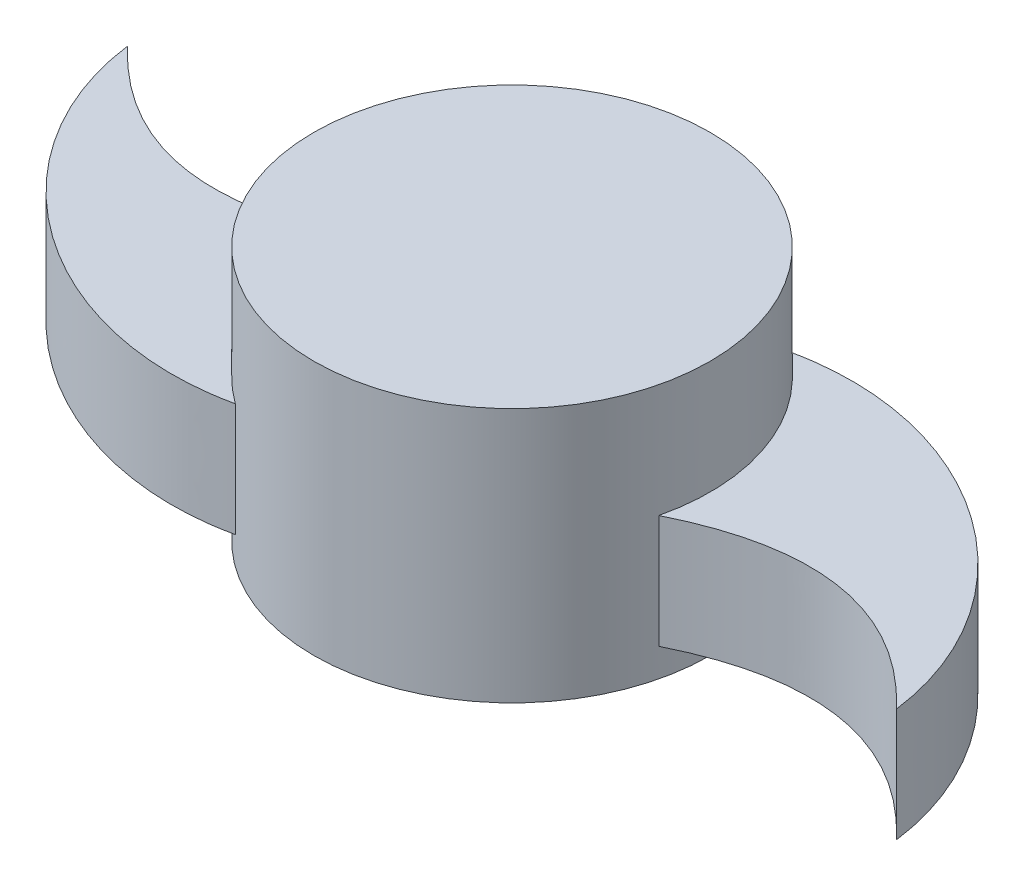
ISO-10303-21;
HEADER;
FILE_DESCRIPTION(('STEP AP214'),'2;1');
FILE_NAME('part.step','',(''),(''),'','','');
FILE_SCHEMA(('AUTOMOTIVE_DESIGN { 1 0 10303 214 1 1 1 1 }'));
ENDSEC;
DATA;
#1=APPLICATION_CONTEXT('core data for automotive mechanical design processes');
#2=APPLICATION_PROTOCOL_DEFINITION('international standard','automotive_design',2000,#1);
#3=PRODUCT_CONTEXT('',#1,'mechanical');
#4=PRODUCT('Part','Part','',(#3));
#5=PRODUCT_RELATED_PRODUCT_CATEGORY('part','',(#4));
#6=PRODUCT_DEFINITION_FORMATION('','',#4);
#7=PRODUCT_DEFINITION_CONTEXT('part definition',#1,'design');
#8=PRODUCT_DEFINITION('design','',#6,#7);
#9=PRODUCT_DEFINITION_SHAPE('','',#8);
#10=(LENGTH_UNIT() NAMED_UNIT(*) SI_UNIT(.MILLI.,.METRE.));
#11=(NAMED_UNIT(*) PLANE_ANGLE_UNIT() SI_UNIT($,.RADIAN.));
#12=(NAMED_UNIT(*) SI_UNIT($,.STERADIAN.) SOLID_ANGLE_UNIT());
#13=UNCERTAINTY_MEASURE_WITH_UNIT(LENGTH_MEASURE(1.E-05),#10,'distance_accuracy_value','');
#14=(GEOMETRIC_REPRESENTATION_CONTEXT(3) GLOBAL_UNCERTAINTY_ASSIGNED_CONTEXT((#13)) GLOBAL_UNIT_ASSIGNED_CONTEXT((#10,
#11,#12)) REPRESENTATION_CONTEXT('',''));
#15=CARTESIAN_POINT('',(0.,0.,0.));
#16=DIRECTION('',(0.,0.,1.));
#17=DIRECTION('',(1.,0.,0.));
#18=AXIS2_PLACEMENT_3D('',#15,#16,#17);
#19=CARTESIAN_POINT('',(0.,57.15,0.));
#20=DIRECTION('',(0.,-1.,0.));
#21=DIRECTION('',(0.,0.,-1.));
#22=AXIS2_PLACEMENT_3D('',#19,#20,#21);
#23=CYLINDRICAL_SURFACE('',#22,44.45);
#24=DIRECTION('',(0.,-1.,0.));
#25=VECTOR('',#24,1.);
#26=CARTESIAN_POINT('',(-43.2341522038029,31.75,-10.3252401046373));
#27=LINE('',#26,#25);
#28=CARTESIAN_POINT('',(-43.2341522038028,31.75,-10.3252401046373));
#29=VERTEX_POINT('',#28);
#30=CARTESIAN_POINT('',(-43.2341522038028,6.35,-10.3252401046373));
#31=VERTEX_POINT('',#30);
#32=EDGE_CURVE('E51',#29,#31,#27,.T.);
#33=ORIENTED_EDGE('',*,*,#32,.F.);
#34=CARTESIAN_POINT('',(0.,31.75,0.));
#35=DIRECTION('',(0.,-1.,0.));
#36=DIRECTION('',(0.,0.,-1.));
#37=AXIS2_PLACEMENT_3D('',#34,#35,#36);
#38=CIRCLE('',#37,44.45);
#39=CARTESIAN_POINT('',(-25.9383628900159,31.75,36.0971443550019));
#40=VERTEX_POINT('',#39);
#41=EDGE_CURVE('E46',#40,#29,#38,.T.);
#42=ORIENTED_EDGE('',*,*,#41,.F.);
#43=DIRECTION('',(0.,-1.,0.));
#44=VECTOR('',#43,1.);
#45=CARTESIAN_POINT('',(-25.9383628900159,31.75,36.0971443550019));
#46=LINE('',#45,#44);
#47=CARTESIAN_POINT('',(-25.9383628900159,6.35,36.0971443550019));
#48=VERTEX_POINT('',#47);
#49=EDGE_CURVE('E99',#40,#48,#46,.T.);
#50=ORIENTED_EDGE('',*,*,#49,.T.);
#51=CARTESIAN_POINT('',(0.,6.35,0.));
#52=DIRECTION('',(0.,-1.,0.));
#53=DIRECTION('',(0.,0.,-1.));
#54=AXIS2_PLACEMENT_3D('',#51,#52,#53);
#55=CIRCLE('',#54,44.45);
#56=EDGE_CURVE('E102',#48,#31,#55,.T.);
#57=ORIENTED_EDGE('',*,*,#56,.T.);
#58=EDGE_LOOP('',(#33,#42,#50,#57));
#59=FACE_BOUND('',#58,.T.);
#60=DIRECTION('',(0.,-1.,0.));
#61=VECTOR('',#60,1.);
#62=CARTESIAN_POINT('',(43.2341522038028,31.75,10.3252401046374));
#63=LINE('',#62,#61);
#64=CARTESIAN_POINT('',(43.2341522038028,31.75,10.3252401046374));
#65=VERTEX_POINT('',#64);
#66=CARTESIAN_POINT('',(43.2341522038028,6.35,10.3252401046374));
#67=VERTEX_POINT('',#66);
#68=EDGE_CURVE('E162',#65,#67,#63,.T.);
#69=ORIENTED_EDGE('',*,*,#68,.F.);
#70=CARTESIAN_POINT('',(0.,31.75,0.));
#71=DIRECTION('',(0.,-1.,0.));
#72=DIRECTION('',(0.,0.,-1.));
#73=AXIS2_PLACEMENT_3D('',#70,#71,#72);
#74=CIRCLE('',#73,44.45);
#75=CARTESIAN_POINT('',(25.9383628900159,31.75,-36.0971443550019));
#76=VERTEX_POINT('',#75);
#77=EDGE_CURVE('E138',#76,#65,#74,.T.);
#78=ORIENTED_EDGE('',*,*,#77,.F.);
#79=DIRECTION('',(0.,-1.,0.));
#80=VECTOR('',#79,1.);
#81=CARTESIAN_POINT('',(25.9383628900159,31.75,-36.0971443550019));
#82=LINE('',#81,#80);
#83=CARTESIAN_POINT('',(25.9383628900159,6.35,-36.0971443550019));
#84=VERTEX_POINT('',#83);
#85=EDGE_CURVE('E165',#76,#84,#82,.T.);
#86=ORIENTED_EDGE('',*,*,#85,.T.);
#87=CARTESIAN_POINT('',(0.,6.35,0.));
#88=DIRECTION('',(0.,-1.,0.));
#89=DIRECTION('',(0.,0.,-1.));
#90=AXIS2_PLACEMENT_3D('',#87,#88,#89);
#91=CIRCLE('',#90,44.45);
#92=EDGE_CURVE('E147',#84,#67,#91,.T.);
#93=ORIENTED_EDGE('',*,*,#92,.T.);
#94=EDGE_LOOP('',(#69,#78,#86,#93));
#95=FACE_BOUND('',#94,.T.);
#96=CARTESIAN_POINT('',(0.,57.15,0.));
#97=DIRECTION('',(0.,1.,0.));
#98=DIRECTION('',(0.,0.,1.));
#99=AXIS2_PLACEMENT_3D('',#96,#97,#98);
#100=CIRCLE('',#99,44.45);
#101=CARTESIAN_POINT('',(0.,57.15,44.45));
#102=VERTEX_POINT('',#101);
#103=EDGE_CURVE('E11',#102,#102,#100,.T.);
#104=ORIENTED_EDGE('',*,*,#103,.F.);
#105=EDGE_LOOP('',(#104));
#106=FACE_BOUND('',#105,.T.);
#107=CARTESIAN_POINT('',(0.,0.,0.));
#108=DIRECTION('',(0.,1.,0.));
#109=DIRECTION('',(0.,0.,1.));
#110=AXIS2_PLACEMENT_3D('',#107,#108,#109);
#111=CIRCLE('',#110,44.45);
#112=CARTESIAN_POINT('',(0.,0.,44.45));
#113=VERTEX_POINT('',#112);
#114=EDGE_CURVE('E35',#113,#113,#111,.T.);
#115=ORIENTED_EDGE('',*,*,#114,.T.);
#116=EDGE_LOOP('',(#115));
#117=FACE_BOUND('',#116,.T.);
#118=ADVANCED_FACE('F32',(#59,#95,#106,#117),#23,.T.);
#119=CARTESIAN_POINT('',(0.,57.15,0.));
#120=DIRECTION('',(0.,1.,0.));
#121=DIRECTION('',(0.,0.,1.));
#122=AXIS2_PLACEMENT_3D('',#119,#120,#121);
#123=PLANE('',#122);
#124=ORIENTED_EDGE('',*,*,#103,.T.);
#125=EDGE_LOOP('',(#124));
#126=FACE_BOUND('',#125,.T.);
#127=ADVANCED_FACE('F175',(#126),#123,.T.);
#128=CARTESIAN_POINT('',(0.,0.,0.));
#129=DIRECTION('',(0.,1.,0.));
#130=DIRECTION('',(0.,0.,1.));
#131=AXIS2_PLACEMENT_3D('',#128,#129,#130);
#132=PLANE('',#131);
#133=ORIENTED_EDGE('',*,*,#114,.F.);
#134=EDGE_LOOP('',(#133));
#135=FACE_BOUND('',#134,.T.);
#136=ADVANCED_FACE('F173',(#135),#132,.F.);
#137=CARTESIAN_POINT('',(107.471459219682,31.75,21.3033686745085));
#138=CARTESIAN_POINT('',(102.789157254803,31.75,-15.3743746848465));
#139=CARTESIAN_POINT('',(62.8492697785304,31.75,-44.250068413422));
#140=CARTESIAN_POINT('',(25.9383628900159,31.75,-36.0971443550019));
#141=B_SPLINE_CURVE_WITH_KNOTS('',3,(#137,#138,#139,#140),.UNSPECIFIED.,.F.,.F.,(4,4),(0.,1.),.UNSPECIFIED.);
#142=DIRECTION('',(0.,-1.,0.));
#143=VECTOR('',#142,1.);
#144=SURFACE_OF_LINEAR_EXTRUSION('',#141,#143);
#145=CARTESIAN_POINT('',(107.471459219682,6.35,21.3033686745085));
#146=CARTESIAN_POINT('',(102.789157254803,6.35,-15.3743746848465));
#147=CARTESIAN_POINT('',(62.8492697785304,6.35,-44.250068413422));
#148=CARTESIAN_POINT('',(25.9383628900159,6.35,-36.0971443550019));
#149=B_SPLINE_CURVE_WITH_KNOTS('',3,(#145,#146,#147,#148),.UNSPECIFIED.,.F.,.F.,(4,4),(0.,1.),.UNSPECIFIED.);
#150=CARTESIAN_POINT('',(107.471459219682,6.35,21.3033686745085));
#151=VERTEX_POINT('',#150);
#152=EDGE_CURVE('E139',#151,#84,#149,.T.);
#153=ORIENTED_EDGE('',*,*,#152,.T.);
#154=ORIENTED_EDGE('',*,*,#85,.F.);
#155=CARTESIAN_POINT('',(107.471459219682,31.75,21.3033686745085));
#156=VERTEX_POINT('',#155);
#157=EDGE_CURVE('E156',#156,#76,#141,.T.);
#158=ORIENTED_EDGE('',*,*,#157,.F.);
#159=DIRECTION('',(0.,-1.,0.));
#160=VECTOR('',#159,1.);
#161=CARTESIAN_POINT('',(107.471459219682,31.75,21.3033686745085));
#162=LINE('',#161,#160);
#163=EDGE_CURVE('E137',#156,#151,#162,.T.);
#164=ORIENTED_EDGE('',*,*,#163,.T.);
#165=EDGE_LOOP('',(#153,#154,#158,#164));
#166=FACE_BOUND('',#165,.T.);
#167=ADVANCED_FACE('F127',(#166),#144,.F.);
#168=CARTESIAN_POINT('',(43.2341522038028,31.75,10.3252401046374));
#169=CARTESIAN_POINT('',(79.9424189658603,31.75,-7.90926282177319));
#170=CARTESIAN_POINT('',(107.471459219682,31.75,21.3033686745085));
#171=B_SPLINE_CURVE_WITH_KNOTS('',2,(#168,#169,#170),.UNSPECIFIED.,.F.,.F.,(3,3),(0.,1.),.UNSPECIFIED.);
#172=DIRECTION('',(0.,-1.,0.));
#173=VECTOR('',#172,1.);
#174=SURFACE_OF_LINEAR_EXTRUSION('',#171,#173);
#175=CARTESIAN_POINT('',(43.2341522038028,6.35,10.3252401046374));
#176=CARTESIAN_POINT('',(79.9424189658603,6.35,-7.90926282177319));
#177=CARTESIAN_POINT('',(107.471459219682,6.35,21.3033686745085));
#178=B_SPLINE_CURVE_WITH_KNOTS('',2,(#175,#176,#177),.UNSPECIFIED.,.F.,.F.,(3,3),(0.,1.),.UNSPECIFIED.);
#179=EDGE_CURVE('E152',#67,#151,#178,.T.);
#180=ORIENTED_EDGE('',*,*,#179,.T.);
#181=ORIENTED_EDGE('',*,*,#163,.F.);
#182=EDGE_CURVE('E131',#65,#156,#171,.T.);
#183=ORIENTED_EDGE('',*,*,#182,.F.);
#184=ORIENTED_EDGE('',*,*,#68,.T.);
#185=EDGE_LOOP('',(#180,#181,#183,#184));
#186=FACE_BOUND('',#185,.T.);
#187=ADVANCED_FACE('F119',(#186),#174,.F.);
#188=CARTESIAN_POINT('',(78.7906379012124,31.75,-24.2083881219123));
#189=DIRECTION('',(0.,1.,0.));
#190=DIRECTION('',(0.,0.,1.));
#191=AXIS2_PLACEMENT_3D('',#188,#189,#190);
#192=PLANE('',#191);
#193=ORIENTED_EDGE('',*,*,#157,.T.);
#194=ORIENTED_EDGE('',*,*,#77,.T.);
#195=ORIENTED_EDGE('',*,*,#182,.T.);
#196=EDGE_LOOP('',(#193,#194,#195));
#197=FACE_BOUND('',#196,.T.);
#198=ADVANCED_FACE('F116',(#197),#192,.T.);
#199=CARTESIAN_POINT('',(78.7906379012124,6.35,-24.2083881219123));
#200=DIRECTION('',(0.,1.,0.));
#201=DIRECTION('',(0.,0.,1.));
#202=AXIS2_PLACEMENT_3D('',#199,#200,#201);
#203=PLANE('',#202);
#204=ORIENTED_EDGE('',*,*,#152,.F.);
#205=ORIENTED_EDGE('',*,*,#179,.F.);
#206=ORIENTED_EDGE('',*,*,#92,.F.);
#207=EDGE_LOOP('',(#204,#205,#206));
#208=FACE_BOUND('',#207,.T.);
#209=ADVANCED_FACE('F114',(#208),#203,.F.);
#210=CARTESIAN_POINT('',(-107.471459219682,31.75,-21.3033686745085));
#211=CARTESIAN_POINT('',(-102.789157254803,31.75,15.3743746848465));
#212=CARTESIAN_POINT('',(-62.8492697785305,31.75,44.250068413422));
#213=CARTESIAN_POINT('',(-25.9383628900159,31.75,36.0971443550019));
#214=B_SPLINE_CURVE_WITH_KNOTS('',3,(#210,#211,#212,#213),.UNSPECIFIED.,.F.,.F.,(4,4),(0.,1.),.UNSPECIFIED.);
#215=DIRECTION('',(0.,-1.,0.));
#216=VECTOR('',#215,1.);
#217=SURFACE_OF_LINEAR_EXTRUSION('',#214,#216);
#218=CARTESIAN_POINT('',(-107.471459219682,6.35,-21.3033686745085));
#219=CARTESIAN_POINT('',(-102.789157254803,6.35,15.3743746848465));
#220=CARTESIAN_POINT('',(-62.8492697785305,6.35,44.250068413422));
#221=CARTESIAN_POINT('',(-25.9383628900159,6.35,36.0971443550019));
#222=B_SPLINE_CURVE_WITH_KNOTS('',3,(#218,#219,#220,#221),.UNSPECIFIED.,.F.,.F.,(4,4),(0.,1.),.UNSPECIFIED.);
#223=CARTESIAN_POINT('',(-107.471459219682,6.35,-21.3033686745085));
#224=VERTEX_POINT('',#223);
#225=EDGE_CURVE('E209',#224,#48,#222,.T.);
#226=ORIENTED_EDGE('',*,*,#225,.T.);
#227=ORIENTED_EDGE('',*,*,#49,.F.);
#228=CARTESIAN_POINT('',(-107.471459219682,31.75,-21.3033686745085));
#229=VERTEX_POINT('',#228);
#230=EDGE_CURVE('E85',#229,#40,#214,.T.);
#231=ORIENTED_EDGE('',*,*,#230,.F.);
#232=DIRECTION('',(0.,-1.,0.));
#233=VECTOR('',#232,1.);
#234=CARTESIAN_POINT('',(-107.471459219682,31.75,-21.3033686745085));
#235=LINE('',#234,#233);
#236=EDGE_CURVE('E88',#229,#224,#235,.T.);
#237=ORIENTED_EDGE('',*,*,#236,.T.);
#238=EDGE_LOOP('',(#226,#227,#231,#237));
#239=FACE_BOUND('',#238,.T.);
#240=ADVANCED_FACE('F98',(#239),#217,.F.);
#241=CARTESIAN_POINT('',(-43.2341522038028,31.75,-10.3252401046373));
#242=CARTESIAN_POINT('',(-79.9424189658602,31.75,7.9092628217732));
#243=CARTESIAN_POINT('',(-107.471459219682,31.75,-21.3033686745085));
#244=B_SPLINE_CURVE_WITH_KNOTS('',2,(#241,#242,#243),.UNSPECIFIED.,.F.,.F.,(3,3),(0.,1.),.UNSPECIFIED.);
#245=DIRECTION('',(0.,-1.,0.));
#246=VECTOR('',#245,1.);
#247=SURFACE_OF_LINEAR_EXTRUSION('',#244,#246);
#248=CARTESIAN_POINT('',(-43.2341522038028,6.35,-10.3252401046373));
#249=CARTESIAN_POINT('',(-79.9424189658602,6.35,7.9092628217732));
#250=CARTESIAN_POINT('',(-107.471459219682,6.35,-21.3033686745085));
#251=B_SPLINE_CURVE_WITH_KNOTS('',2,(#248,#249,#250),.UNSPECIFIED.,.F.,.F.,(3,3),(0.,1.),.UNSPECIFIED.);
#252=EDGE_CURVE('E93',#31,#224,#251,.T.);
#253=ORIENTED_EDGE('',*,*,#252,.T.);
#254=ORIENTED_EDGE('',*,*,#236,.F.);
#255=EDGE_CURVE('E81',#29,#229,#244,.T.);
#256=ORIENTED_EDGE('',*,*,#255,.F.);
#257=ORIENTED_EDGE('',*,*,#32,.T.);
#258=EDGE_LOOP('',(#253,#254,#256,#257));
#259=FACE_BOUND('',#258,.T.);
#260=ADVANCED_FACE('F91',(#259),#247,.F.);
#261=CARTESIAN_POINT('',(-78.7906379012124,31.75,24.2083881219124));
#262=DIRECTION('',(0.,1.,0.));
#263=DIRECTION('',(0.,0.,1.));
#264=AXIS2_PLACEMENT_3D('',#261,#262,#263);
#265=PLANE('',#264);
#266=ORIENTED_EDGE('',*,*,#230,.T.);
#267=ORIENTED_EDGE('',*,*,#41,.T.);
#268=ORIENTED_EDGE('',*,*,#255,.T.);
#269=EDGE_LOOP('',(#266,#267,#268));
#270=FACE_BOUND('',#269,.T.);
#271=ADVANCED_FACE('F83',(#270),#265,.T.);
#272=CARTESIAN_POINT('',(-78.7906379012124,6.35,24.2083881219124));
#273=DIRECTION('',(0.,1.,0.));
#274=DIRECTION('',(0.,0.,1.));
#275=AXIS2_PLACEMENT_3D('',#272,#273,#274);
#276=PLANE('',#275);
#277=ORIENTED_EDGE('',*,*,#225,.F.);
#278=ORIENTED_EDGE('',*,*,#252,.F.);
#279=ORIENTED_EDGE('',*,*,#56,.F.);
#280=EDGE_LOOP('',(#277,#278,#279));
#281=FACE_BOUND('',#280,.T.);
#282=ADVANCED_FACE('F223',(#281),#276,.F.);
#283=CLOSED_SHELL('',(#118,#127,#136,#167,#187,#198,#209,#240,#260,#271,#282));
#284=MANIFOLD_SOLID_BREP('B2',#283);
#285=ADVANCED_BREP_SHAPE_REPRESENTATION('',(#18,#284),#14);
#286=SHAPE_DEFINITION_REPRESENTATION(#9,#285);
ENDSEC;
END-ISO-10303-21;
